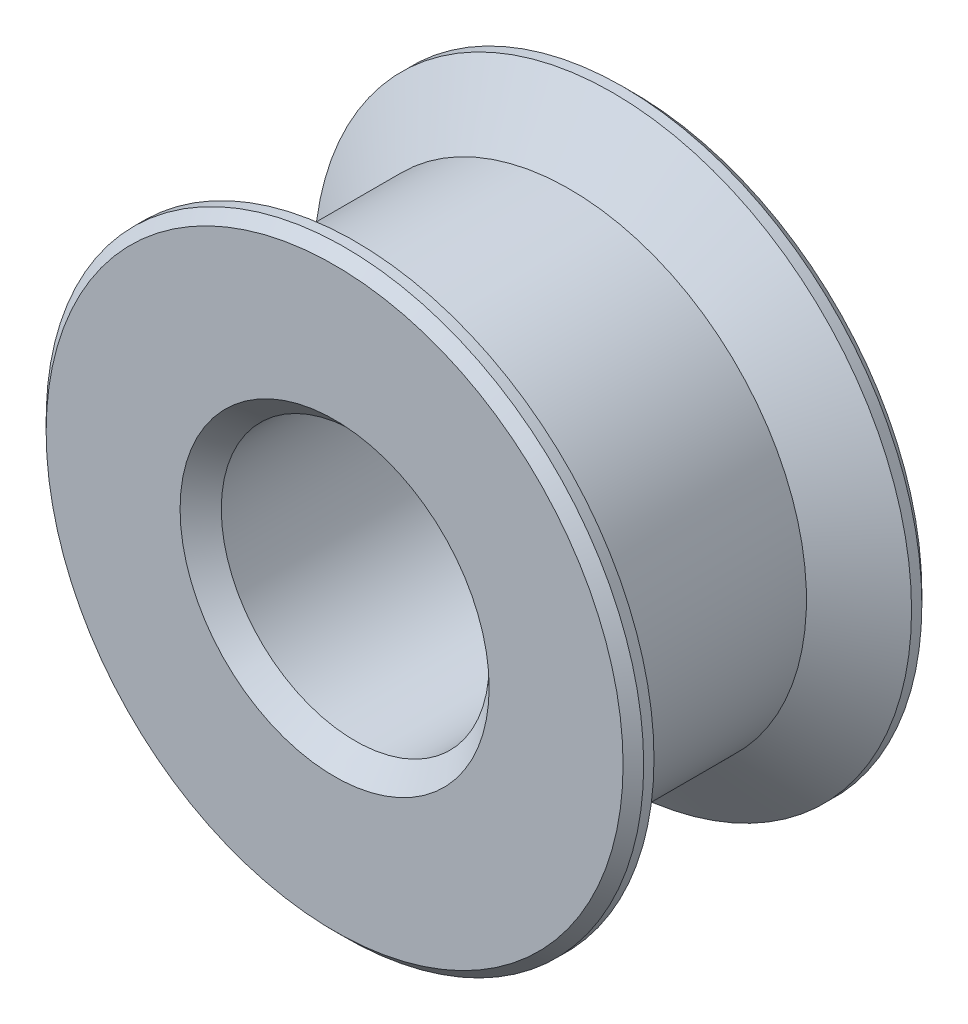
ISO-10303-21;
HEADER;
FILE_DESCRIPTION(('STEP AP214'),'2;1');
FILE_NAME('part.step','',(''),(''),'','','');
FILE_SCHEMA(('AUTOMOTIVE_DESIGN { 1 0 10303 214 1 1 1 1 }'));
ENDSEC;
DATA;
#1=APPLICATION_CONTEXT('core data for automotive mechanical design processes');
#2=APPLICATION_PROTOCOL_DEFINITION('international standard','automotive_design',2000,#1);
#3=PRODUCT_CONTEXT('',#1,'mechanical');
#4=PRODUCT('Part','Part','',(#3));
#5=PRODUCT_RELATED_PRODUCT_CATEGORY('part','',(#4));
#6=PRODUCT_DEFINITION_FORMATION('','',#4);
#7=PRODUCT_DEFINITION_CONTEXT('part definition',#1,'design');
#8=PRODUCT_DEFINITION('design','',#6,#7);
#9=PRODUCT_DEFINITION_SHAPE('','',#8);
#10=(LENGTH_UNIT() NAMED_UNIT(*) SI_UNIT(.MILLI.,.METRE.));
#11=(NAMED_UNIT(*) PLANE_ANGLE_UNIT() SI_UNIT($,.RADIAN.));
#12=(NAMED_UNIT(*) SI_UNIT($,.STERADIAN.) SOLID_ANGLE_UNIT());
#13=UNCERTAINTY_MEASURE_WITH_UNIT(LENGTH_MEASURE(1.E-05),#10,'distance_accuracy_value','');
#14=(GEOMETRIC_REPRESENTATION_CONTEXT(3) GLOBAL_UNCERTAINTY_ASSIGNED_CONTEXT((#13)) GLOBAL_UNIT_ASSIGNED_CONTEXT((#10,
#11,#12)) REPRESENTATION_CONTEXT('',''));
#15=CARTESIAN_POINT('',(0.,0.,0.));
#16=DIRECTION('',(0.,0.,1.));
#17=DIRECTION('',(1.,0.,0.));
#18=AXIS2_PLACEMENT_3D('',#15,#16,#17);
#19=CARTESIAN_POINT('',(0.,0.,6.25));
#20=DIRECTION('',(0.,0.,-1.));
#21=DIRECTION('',(-1.,0.,0.));
#22=AXIS2_PLACEMENT_3D('',#19,#20,#21);
#23=CYLINDRICAL_SURFACE('',#22,11.5);
#24=CARTESIAN_POINT('',(0.,0.,-4.14937738537086));
#25=DIRECTION('',(0.,0.,-1.));
#26=DIRECTION('',(-1.,0.,0.));
#27=AXIS2_PLACEMENT_3D('',#24,#25,#26);
#28=CIRCLE('',#27,11.5);
#29=CARTESIAN_POINT('',(-11.5,0.,-4.14937738537086));
#30=VERTEX_POINT('',#29);
#31=EDGE_CURVE('E65',#30,#30,#28,.F.);
#32=ORIENTED_EDGE('',*,*,#31,.T.);
#33=EDGE_LOOP('',(#32));
#34=FACE_BOUND('',#33,.T.);
#35=CARTESIAN_POINT('',(0.,0.,4.14937738537087));
#36=DIRECTION('',(0.,0.,1.));
#37=DIRECTION('',(1.,0.,0.));
#38=AXIS2_PLACEMENT_3D('',#35,#36,#37);
#39=CIRCLE('',#38,11.5);
#40=CARTESIAN_POINT('',(11.5,0.,4.14937738537087));
#41=VERTEX_POINT('',#40);
#42=EDGE_CURVE('E68',#41,#41,#39,.F.);
#43=ORIENTED_EDGE('',*,*,#42,.T.);
#44=EDGE_LOOP('',(#43));
#45=FACE_BOUND('',#44,.T.);
#46=ADVANCED_FACE('F32',(#34,#45),#23,.T.);
#47=CARTESIAN_POINT('',(0.,0.,6.25));
#48=DIRECTION('',(0.,0.,-1.));
#49=DIRECTION('',(-1.,0.,0.));
#50=AXIS2_PLACEMENT_3D('',#47,#48,#49);
#51=CYLINDRICAL_SURFACE('',#50,6.5);
#52=CARTESIAN_POINT('',(0.,0.,-6.24999999999999));
#53=DIRECTION('',(0.,0.,-1.));
#54=DIRECTION('',(-1.,0.,0.));
#55=AXIS2_PLACEMENT_3D('',#52,#53,#54);
#56=CIRCLE('',#55,6.5);
#57=CARTESIAN_POINT('',(-6.5,0.,-6.24999999999999));
#58=VERTEX_POINT('',#57);
#59=EDGE_CURVE('E56',#58,#58,#56,.T.);
#60=ORIENTED_EDGE('',*,*,#59,.T.);
#61=EDGE_LOOP('',(#60));
#62=FACE_BOUND('',#61,.T.);
#63=CARTESIAN_POINT('',(0.,0.,6.25));
#64=DIRECTION('',(0.,0.,1.));
#65=DIRECTION('',(1.,0.,0.));
#66=AXIS2_PLACEMENT_3D('',#63,#64,#65);
#67=CIRCLE('',#66,6.5);
#68=CARTESIAN_POINT('',(6.5,0.,6.25));
#69=VERTEX_POINT('',#68);
#70=EDGE_CURVE('E59',#69,#69,#67,.T.);
#71=ORIENTED_EDGE('',*,*,#70,.T.);
#72=EDGE_LOOP('',(#71));
#73=FACE_BOUND('',#72,.T.);
#74=ADVANCED_FACE('F97',(#62,#73),#51,.F.);
#75=CARTESIAN_POINT('',(0.,0.,7.25));
#76=DIRECTION('',(0.,0.,1.));
#77=DIRECTION('',(1.,0.,0.));
#78=AXIS2_PLACEMENT_3D('',#75,#76,#77);
#79=PLANE('',#78);
#80=CARTESIAN_POINT('',(0.,0.,7.25));
#81=DIRECTION('',(0.,0.,1.));
#82=DIRECTION('',(1.,0.,0.));
#83=AXIS2_PLACEMENT_3D('',#80,#81,#82);
#84=CIRCLE('',#83,14.);
#85=CARTESIAN_POINT('',(14.,0.,7.25));
#86=VERTEX_POINT('',#85);
#87=EDGE_CURVE('E40',#86,#86,#84,.T.);
#88=ORIENTED_EDGE('',*,*,#87,.T.);
#89=EDGE_LOOP('',(#88));
#90=FACE_BOUND('',#89,.T.);
#91=CARTESIAN_POINT('',(0.,0.,7.25));
#92=DIRECTION('',(0.,0.,1.));
#93=DIRECTION('',(1.,0.,0.));
#94=AXIS2_PLACEMENT_3D('',#91,#92,#93);
#95=CIRCLE('',#94,7.5);
#96=CARTESIAN_POINT('',(7.5,0.,7.25));
#97=VERTEX_POINT('',#96);
#98=EDGE_CURVE('E53',#97,#97,#95,.F.);
#99=ORIENTED_EDGE('',*,*,#98,.T.);
#100=EDGE_LOOP('',(#99));
#101=FACE_BOUND('',#100,.T.);
#102=ADVANCED_FACE('F93',(#90,#101),#79,.T.);
#103=CARTESIAN_POINT('',(0.,0.,7.25));
#104=DIRECTION('',(0.,0.,-1.));
#105=DIRECTION('',(-1.,0.,0.));
#106=AXIS2_PLACEMENT_3D('',#103,#104,#105);
#107=CYLINDRICAL_SURFACE('',#106,14.5);
#108=CARTESIAN_POINT('',(0.,0.,6.75000000000001));
#109=DIRECTION('',(0.,0.,1.));
#110=DIRECTION('',(1.,0.,0.));
#111=AXIS2_PLACEMENT_3D('',#108,#109,#110);
#112=CIRCLE('',#111,14.5);
#113=CARTESIAN_POINT('',(14.5,0.,6.75000000000001));
#114=VERTEX_POINT('',#113);
#115=EDGE_CURVE('E10',#114,#114,#112,.F.);
#116=ORIENTED_EDGE('',*,*,#115,.T.);
#117=EDGE_LOOP('',(#116));
#118=FACE_BOUND('',#117,.T.);
#119=CARTESIAN_POINT('',(0.,0.,6.25));
#120=DIRECTION('',(0.,0.,1.));
#121=DIRECTION('',(1.,0.,0.));
#122=AXIS2_PLACEMENT_3D('',#119,#120,#121);
#123=CIRCLE('',#122,14.5);
#124=CARTESIAN_POINT('',(14.5,0.,6.25));
#125=VERTEX_POINT('',#124);
#126=EDGE_CURVE('E71',#125,#125,#123,.T.);
#127=ORIENTED_EDGE('',*,*,#126,.T.);
#128=EDGE_LOOP('',(#127));
#129=FACE_BOUND('',#128,.T.);
#130=ADVANCED_FACE('F84',(#118,#129),#107,.T.);
#131=CARTESIAN_POINT('',(0.,0.,-7.25));
#132=DIRECTION('',(0.,0.,1.));
#133=DIRECTION('',(1.,0.,0.));
#134=AXIS2_PLACEMENT_3D('',#131,#132,#133);
#135=CYLINDRICAL_SURFACE('',#134,14.5);
#136=CARTESIAN_POINT('',(0.,0.,-6.74999999999999));
#137=DIRECTION('',(0.,0.,-1.));
#138=DIRECTION('',(-1.,0.,0.));
#139=AXIS2_PLACEMENT_3D('',#136,#137,#138);
#140=CIRCLE('',#139,14.5);
#141=CARTESIAN_POINT('',(-14.5,0.,-6.74999999999999));
#142=VERTEX_POINT('',#141);
#143=EDGE_CURVE('E48',#142,#142,#140,.F.);
#144=ORIENTED_EDGE('',*,*,#143,.T.);
#145=EDGE_LOOP('',(#144));
#146=FACE_BOUND('',#145,.T.);
#147=CARTESIAN_POINT('',(0.,0.,-6.25));
#148=DIRECTION('',(0.,0.,1.));
#149=DIRECTION('',(1.,0.,0.));
#150=AXIS2_PLACEMENT_3D('',#147,#148,#149);
#151=CIRCLE('',#150,14.5);
#152=CARTESIAN_POINT('',(14.5,0.,-6.25));
#153=VERTEX_POINT('',#152);
#154=EDGE_CURVE('E74',#153,#153,#151,.T.);
#155=ORIENTED_EDGE('',*,*,#154,.F.);
#156=EDGE_LOOP('',(#155));
#157=FACE_BOUND('',#156,.T.);
#158=ADVANCED_FACE('F81',(#146,#157),#135,.T.);
#159=CARTESIAN_POINT('',(0.,0.,-7.25));
#160=DIRECTION('',(0.,0.,-1.));
#161=DIRECTION('',(1.,0.,0.));
#162=AXIS2_PLACEMENT_3D('',#159,#160,#161);
#163=PLANE('',#162);
#164=CARTESIAN_POINT('',(0.,0.,-7.25));
#165=DIRECTION('',(0.,0.,-1.));
#166=DIRECTION('',(-1.,0.,0.));
#167=AXIS2_PLACEMENT_3D('',#164,#165,#166);
#168=CIRCLE('',#167,14.);
#169=CARTESIAN_POINT('',(-14.,0.,-7.25));
#170=VERTEX_POINT('',#169);
#171=EDGE_CURVE('E44',#170,#170,#168,.T.);
#172=ORIENTED_EDGE('',*,*,#171,.T.);
#173=EDGE_LOOP('',(#172));
#174=FACE_BOUND('',#173,.T.);
#175=CARTESIAN_POINT('',(0.,0.,-7.25));
#176=DIRECTION('',(0.,0.,-1.));
#177=DIRECTION('',(-1.,0.,0.));
#178=AXIS2_PLACEMENT_3D('',#175,#176,#177);
#179=CIRCLE('',#178,7.5);
#180=CARTESIAN_POINT('',(-7.5,0.,-7.25));
#181=VERTEX_POINT('',#180);
#182=EDGE_CURVE('E62',#181,#181,#179,.F.);
#183=ORIENTED_EDGE('',*,*,#182,.T.);
#184=EDGE_LOOP('',(#183));
#185=FACE_BOUND('',#184,.T.);
#186=ADVANCED_FACE('F83',(#174,#185),#163,.T.);
#187=CARTESIAN_POINT('',(0.,0.,-4.14937738537086));
#188=DIRECTION('',(0.,0.,-1.));
#189=DIRECTION('',(-1.,0.,0.));
#190=AXIS2_PLACEMENT_3D('',#187,#188,#189);
#191=CONICAL_SURFACE('',#190,11.5,0.959931088596877);
#192=ORIENTED_EDGE('',*,*,#154,.T.);
#193=EDGE_LOOP('',(#192));
#194=FACE_BOUND('',#193,.T.);
#195=ORIENTED_EDGE('',*,*,#31,.F.);
#196=EDGE_LOOP('',(#195));
#197=FACE_BOUND('',#196,.T.);
#198=ADVANCED_FACE('F78',(#194,#197),#191,.T.);
#199=CARTESIAN_POINT('',(0.,0.,6.25));
#200=DIRECTION('',(0.,0.,1.));
#201=DIRECTION('',(1.,0.,0.));
#202=AXIS2_PLACEMENT_3D('',#199,#200,#201);
#203=CONICAL_SURFACE('',#202,14.5,0.959931088596877);
#204=ORIENTED_EDGE('',*,*,#42,.F.);
#205=EDGE_LOOP('',(#204));
#206=FACE_BOUND('',#205,.T.);
#207=ORIENTED_EDGE('',*,*,#126,.F.);
#208=EDGE_LOOP('',(#207));
#209=FACE_BOUND('',#208,.T.);
#210=ADVANCED_FACE('F113',(#206,#209),#203,.T.);
#211=CARTESIAN_POINT('',(0.,0.,-7.25));
#212=DIRECTION('',(0.,0.,-1.));
#213=DIRECTION('',(-1.,0.,0.));
#214=AXIS2_PLACEMENT_3D('',#211,#212,#213);
#215=CONICAL_SURFACE('',#214,7.5,0.785398163397446);
#216=ORIENTED_EDGE('',*,*,#59,.F.);
#217=EDGE_LOOP('',(#216));
#218=FACE_BOUND('',#217,.T.);
#219=ORIENTED_EDGE('',*,*,#182,.F.);
#220=EDGE_LOOP('',(#219));
#221=FACE_BOUND('',#220,.T.);
#222=ADVANCED_FACE('F119',(#218,#221),#215,.F.);
#223=CARTESIAN_POINT('',(0.,0.,6.25));
#224=DIRECTION('',(0.,0.,1.));
#225=DIRECTION('',(1.,0.,0.));
#226=AXIS2_PLACEMENT_3D('',#223,#224,#225);
#227=CONICAL_SURFACE('',#226,6.5,0.78539816339745);
#228=ORIENTED_EDGE('',*,*,#98,.F.);
#229=EDGE_LOOP('',(#228));
#230=FACE_BOUND('',#229,.T.);
#231=ORIENTED_EDGE('',*,*,#70,.F.);
#232=EDGE_LOOP('',(#231));
#233=FACE_BOUND('',#232,.T.);
#234=ADVANCED_FACE('F126',(#230,#233),#227,.F.);
#235=CARTESIAN_POINT('',(0.,0.,-6.74999999999999));
#236=DIRECTION('',(0.,0.,1.));
#237=DIRECTION('',(1.,0.,0.));
#238=AXIS2_PLACEMENT_3D('',#235,#236,#237);
#239=CONICAL_SURFACE('',#238,14.5,0.78539816339745);
#240=ORIENTED_EDGE('',*,*,#171,.F.);
#241=EDGE_LOOP('',(#240));
#242=FACE_BOUND('',#241,.T.);
#243=ORIENTED_EDGE('',*,*,#143,.F.);
#244=EDGE_LOOP('',(#243));
#245=FACE_BOUND('',#244,.T.);
#246=ADVANCED_FACE('F132',(#242,#245),#239,.T.);
#247=CARTESIAN_POINT('',(0.,0.,7.25));
#248=DIRECTION('',(0.,0.,-1.));
#249=DIRECTION('',(-1.,0.,0.));
#250=AXIS2_PLACEMENT_3D('',#247,#248,#249);
#251=CONICAL_SURFACE('',#250,14.,0.785398163397448);
#252=ORIENTED_EDGE('',*,*,#115,.F.);
#253=EDGE_LOOP('',(#252));
#254=FACE_BOUND('',#253,.T.);
#255=ORIENTED_EDGE('',*,*,#87,.F.);
#256=EDGE_LOOP('',(#255));
#257=FACE_BOUND('',#256,.T.);
#258=ADVANCED_FACE('F35',(#254,#257),#251,.T.);
#259=CLOSED_SHELL('',(#46,#74,#102,#130,#158,#186,#198,#210,#222,#234,#246,#258));
#260=MANIFOLD_SOLID_BREP('B2',#259);
#261=ADVANCED_BREP_SHAPE_REPRESENTATION('',(#18,#260),#14);
#262=SHAPE_DEFINITION_REPRESENTATION(#9,#261);
ENDSEC;
END-ISO-10303-21;
